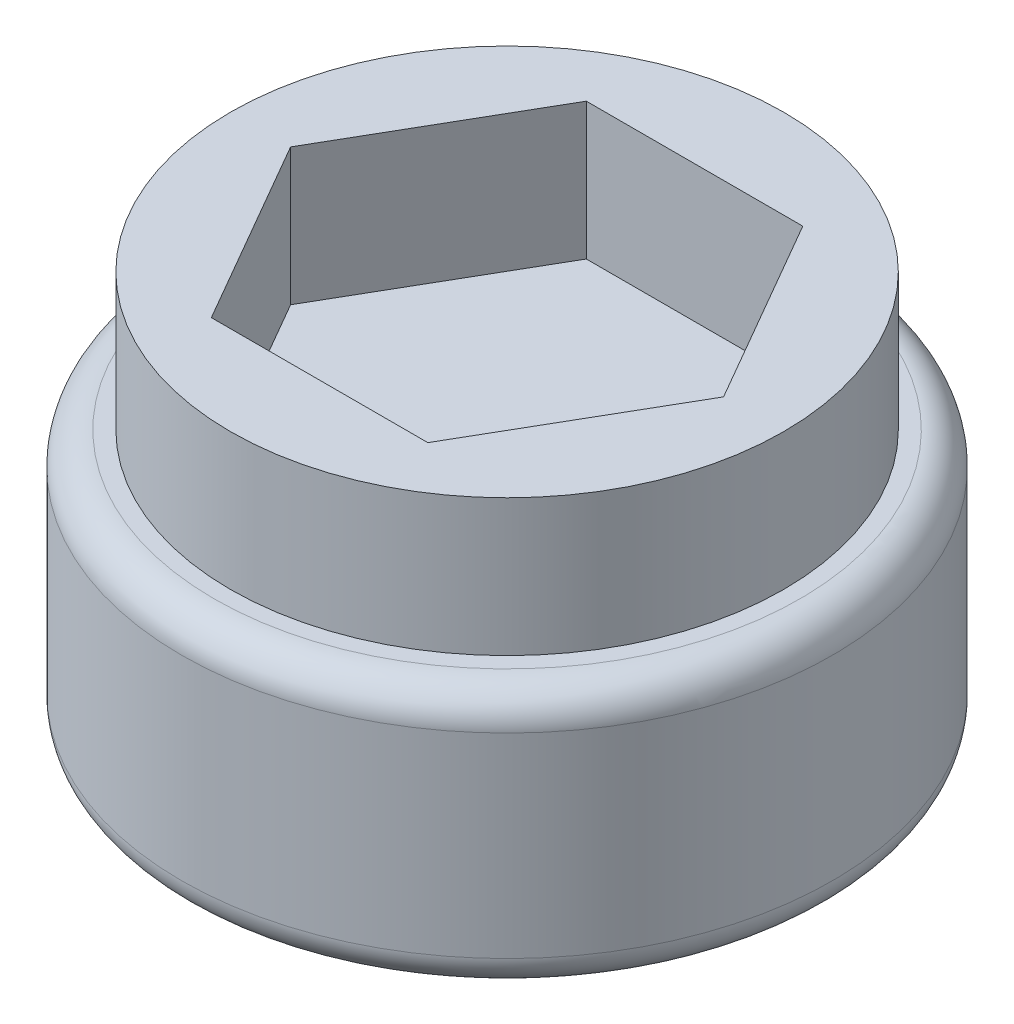
ISO-10303-21;
HEADER;
FILE_DESCRIPTION(('STEP AP214'),'2;1');
FILE_NAME('part.step','',(''),(''),'','','');
FILE_SCHEMA(('AUTOMOTIVE_DESIGN { 1 0 10303 214 1 1 1 1 }'));
ENDSEC;
DATA;
#1=APPLICATION_CONTEXT('core data for automotive mechanical design processes');
#2=APPLICATION_PROTOCOL_DEFINITION('international standard','automotive_design',2000,#1);
#3=PRODUCT_CONTEXT('',#1,'mechanical');
#4=PRODUCT('Part','Part','',(#3));
#5=PRODUCT_RELATED_PRODUCT_CATEGORY('part','',(#4));
#6=PRODUCT_DEFINITION_FORMATION('','',#4);
#7=PRODUCT_DEFINITION_CONTEXT('part definition',#1,'design');
#8=PRODUCT_DEFINITION('design','',#6,#7);
#9=PRODUCT_DEFINITION_SHAPE('','',#8);
#10=(LENGTH_UNIT() NAMED_UNIT(*) SI_UNIT(.MILLI.,.METRE.));
#11=(NAMED_UNIT(*) PLANE_ANGLE_UNIT() SI_UNIT($,.RADIAN.));
#12=(NAMED_UNIT(*) SI_UNIT($,.STERADIAN.) SOLID_ANGLE_UNIT());
#13=UNCERTAINTY_MEASURE_WITH_UNIT(LENGTH_MEASURE(1.E-05),#10,'distance_accuracy_value','');
#14=(GEOMETRIC_REPRESENTATION_CONTEXT(3) GLOBAL_UNCERTAINTY_ASSIGNED_CONTEXT((#13)) GLOBAL_UNIT_ASSIGNED_CONTEXT((#10,
#11,#12)) REPRESENTATION_CONTEXT('',''));
#15=CARTESIAN_POINT('',(0.,0.,0.));
#16=DIRECTION('',(0.,0.,1.));
#17=DIRECTION('',(1.,0.,0.));
#18=AXIS2_PLACEMENT_3D('',#15,#16,#17);
#19=CARTESIAN_POINT('',(0.,9.25,0.));
#20=DIRECTION('',(0.,1.,0.));
#21=DIRECTION('',(0.,0.,1.));
#22=AXIS2_PLACEMENT_3D('',#19,#20,#21);
#23=PLANE('',#22);
#24=CARTESIAN_POINT('',(0.,9.25,0.));
#25=DIRECTION('',(0.,1.,0.));
#26=DIRECTION('',(0.,0.,1.));
#27=AXIS2_PLACEMENT_3D('',#24,#25,#26);
#28=CIRCLE('',#27,4.5);
#29=CARTESIAN_POINT('',(0.,9.25,4.5));
#30=VERTEX_POINT('',#29);
#31=EDGE_CURVE('E11',#30,#30,#28,.T.);
#32=ORIENTED_EDGE('',*,*,#31,.T.);
#33=EDGE_LOOP('',(#32));
#34=FACE_BOUND('',#33,.T.);
#35=CARTESIAN_POINT('',(0.,9.25,0.));
#36=DIRECTION('',(0.,1.,0.));
#37=DIRECTION('',(0.,0.,1.));
#38=AXIS2_PLACEMENT_3D('',#35,#36,#37);
#39=CIRCLE('',#38,4.25);
#40=CARTESIAN_POINT('',(0.,9.25,4.25));
#41=VERTEX_POINT('',#40);
#42=EDGE_CURVE('E109',#41,#41,#39,.T.);
#43=ORIENTED_EDGE('',*,*,#42,.F.);
#44=EDGE_LOOP('',(#43));
#45=FACE_BOUND('',#44,.T.);
#46=ADVANCED_FACE('F35',(#34,#45),#23,.T.);
#47=CARTESIAN_POINT('',(0.,5.25,0.));
#48=DIRECTION('',(0.,1.,0.));
#49=DIRECTION('',(0.,0.,1.));
#50=AXIS2_PLACEMENT_3D('',#47,#48,#49);
#51=PLANE('',#50);
#52=CARTESIAN_POINT('',(0.,5.25,0.));
#53=DIRECTION('',(0.,1.,0.));
#54=DIRECTION('',(0.,0.,1.));
#55=AXIS2_PLACEMENT_3D('',#52,#53,#54);
#56=CIRCLE('',#55,4.5);
#57=CARTESIAN_POINT('',(0.,5.25,4.5));
#58=VERTEX_POINT('',#57);
#59=EDGE_CURVE('E43',#58,#58,#56,.F.);
#60=ORIENTED_EDGE('',*,*,#59,.T.);
#61=EDGE_LOOP('',(#60));
#62=FACE_BOUND('',#61,.T.);
#63=ADVANCED_FACE('F156',(#62),#51,.F.);
#64=CARTESIAN_POINT('',(0.,5.25,0.));
#65=DIRECTION('',(0.,1.,0.));
#66=DIRECTION('',(0.,0.,1.));
#67=AXIS2_PLACEMENT_3D('',#64,#65,#66);
#68=CYLINDRICAL_SURFACE('',#67,5.);
#69=CARTESIAN_POINT('',(0.,5.75,0.));
#70=DIRECTION('',(0.,1.,0.));
#71=DIRECTION('',(0.,0.,1.));
#72=AXIS2_PLACEMENT_3D('',#69,#70,#71);
#73=CIRCLE('',#72,5.);
#74=CARTESIAN_POINT('',(0.,5.75,5.));
#75=VERTEX_POINT('',#74);
#76=EDGE_CURVE('E151',#75,#75,#73,.T.);
#77=ORIENTED_EDGE('',*,*,#76,.T.);
#78=EDGE_LOOP('',(#77));
#79=FACE_BOUND('',#78,.T.);
#80=CARTESIAN_POINT('',(0.,8.75,0.));
#81=DIRECTION('',(0.,1.,0.));
#82=DIRECTION('',(0.,0.,1.));
#83=AXIS2_PLACEMENT_3D('',#80,#81,#82);
#84=CIRCLE('',#83,5.);
#85=CARTESIAN_POINT('',(0.,8.75,5.));
#86=VERTEX_POINT('',#85);
#87=EDGE_CURVE('E96',#86,#86,#84,.F.);
#88=ORIENTED_EDGE('',*,*,#87,.T.);
#89=EDGE_LOOP('',(#88));
#90=FACE_BOUND('',#89,.T.);
#91=ADVANCED_FACE('F161',(#79,#90),#68,.T.);
#92=CARTESIAN_POINT('',(0.,5.75,0.));
#93=DIRECTION('',(0.,1.,0.));
#94=DIRECTION('',(0.,0.,1.));
#95=AXIS2_PLACEMENT_3D('',#92,#93,#94);
#96=TOROIDAL_SURFACE('',#95,4.5,0.5);
#97=ORIENTED_EDGE('',*,*,#59,.F.);
#98=EDGE_LOOP('',(#97));
#99=FACE_BOUND('',#98,.T.);
#100=ORIENTED_EDGE('',*,*,#76,.F.);
#101=EDGE_LOOP('',(#100));
#102=FACE_BOUND('',#101,.T.);
#103=ADVANCED_FACE('F158',(#99,#102),#96,.T.);
#104=CARTESIAN_POINT('',(0.,8.75,0.));
#105=DIRECTION('',(0.,1.,0.));
#106=DIRECTION('',(0.,0.,1.));
#107=AXIS2_PLACEMENT_3D('',#104,#105,#106);
#108=TOROIDAL_SURFACE('',#107,4.5,0.5);
#109=ORIENTED_EDGE('',*,*,#87,.F.);
#110=EDGE_LOOP('',(#109));
#111=FACE_BOUND('',#110,.T.);
#112=ORIENTED_EDGE('',*,*,#31,.F.);
#113=EDGE_LOOP('',(#112));
#114=FACE_BOUND('',#113,.T.);
#115=ADVANCED_FACE('F37',(#111,#114),#108,.T.);
#116=CARTESIAN_POINT('',(2.49415316289918,11.35,1.44));
#117=DIRECTION('',(-0.866025403784439,0.,-0.5));
#118=DIRECTION('',(-0.5,0.,0.866025403784439));
#119=AXIS2_PLACEMENT_3D('',#116,#117,#118);
#120=PLANE('',#119);
#121=DIRECTION('',(0.5,0.,-0.866025403784439));
#122=VECTOR('',#121,1.);
#123=CARTESIAN_POINT('',(2.49415316289918,9.25,1.44));
#124=LINE('',#123,#122);
#125=CARTESIAN_POINT('',(1.66276877526612,9.25,2.88));
#126=VERTEX_POINT('',#125);
#127=CARTESIAN_POINT('',(3.32553755053224,9.25,0.));
#128=VERTEX_POINT('',#127);
#129=EDGE_CURVE('E93',#126,#128,#124,.T.);
#130=ORIENTED_EDGE('',*,*,#129,.F.);
#131=DIRECTION('',(0.,-1.,0.));
#132=VECTOR('',#131,1.);
#133=CARTESIAN_POINT('',(1.66276877526612,11.35,2.88));
#134=LINE('',#133,#132);
#135=CARTESIAN_POINT('',(1.66276877526612,11.35,2.88));
#136=VERTEX_POINT('',#135);
#137=EDGE_CURVE('E87',#136,#126,#134,.T.);
#138=ORIENTED_EDGE('',*,*,#137,.F.);
#139=DIRECTION('',(0.5,0.,-0.866025403784439));
#140=VECTOR('',#139,1.);
#141=CARTESIAN_POINT('',(2.49415316289918,11.35,1.44));
#142=LINE('',#141,#140);
#143=CARTESIAN_POINT('',(3.32553755053224,11.35,0.));
#144=VERTEX_POINT('',#143);
#145=EDGE_CURVE('E91',#136,#144,#142,.T.);
#146=ORIENTED_EDGE('',*,*,#145,.T.);
#147=DIRECTION('',(0.,-1.,0.));
#148=VECTOR('',#147,1.);
#149=CARTESIAN_POINT('',(3.32553755053224,11.35,0.));
#150=LINE('',#149,#148);
#151=EDGE_CURVE('E126',#144,#128,#150,.T.);
#152=ORIENTED_EDGE('',*,*,#151,.T.);
#153=EDGE_LOOP('',(#130,#138,#146,#152));
#154=FACE_BOUND('',#153,.T.);
#155=ADVANCED_FACE('F89',(#154),#120,.T.);
#156=CARTESIAN_POINT('',(0.,11.35,2.88));
#157=DIRECTION('',(0.,0.,-1.));
#158=DIRECTION('',(-1.,0.,0.));
#159=AXIS2_PLACEMENT_3D('',#156,#157,#158);
#160=PLANE('',#159);
#161=DIRECTION('',(1.,0.,0.));
#162=VECTOR('',#161,1.);
#163=CARTESIAN_POINT('',(0.,9.25,2.88));
#164=LINE('',#163,#162);
#165=CARTESIAN_POINT('',(-1.66276877526611,9.25,2.88));
#166=VERTEX_POINT('',#165);
#167=EDGE_CURVE('E50',#166,#126,#164,.T.);
#168=ORIENTED_EDGE('',*,*,#167,.F.);
#169=DIRECTION('',(0.,-1.,0.));
#170=VECTOR('',#169,1.);
#171=CARTESIAN_POINT('',(-1.66276877526611,11.35,2.88));
#172=LINE('',#171,#170);
#173=CARTESIAN_POINT('',(-1.66276877526611,11.35,2.88));
#174=VERTEX_POINT('',#173);
#175=EDGE_CURVE('E97',#174,#166,#172,.T.);
#176=ORIENTED_EDGE('',*,*,#175,.F.);
#177=DIRECTION('',(1.,0.,0.));
#178=VECTOR('',#177,1.);
#179=CARTESIAN_POINT('',(0.,11.35,2.88));
#180=LINE('',#179,#178);
#181=EDGE_CURVE('E104',#174,#136,#180,.T.);
#182=ORIENTED_EDGE('',*,*,#181,.T.);
#183=ORIENTED_EDGE('',*,*,#137,.T.);
#184=EDGE_LOOP('',(#168,#176,#182,#183));
#185=FACE_BOUND('',#184,.T.);
#186=ADVANCED_FACE('F111',(#185),#160,.T.);
#187=CARTESIAN_POINT('',(-2.49415316289918,11.35,1.44));
#188=DIRECTION('',(0.866025403784439,0.,-0.5));
#189=DIRECTION('',(-0.5,0.,-0.866025403784439));
#190=AXIS2_PLACEMENT_3D('',#187,#188,#189);
#191=PLANE('',#190);
#192=DIRECTION('',(0.5,0.,0.866025403784439));
#193=VECTOR('',#192,1.);
#194=CARTESIAN_POINT('',(-2.49415316289918,9.25,1.44));
#195=LINE('',#194,#193);
#196=CARTESIAN_POINT('',(-3.32553755053224,9.25,0.));
#197=VERTEX_POINT('',#196);
#198=EDGE_CURVE('E55',#197,#166,#195,.T.);
#199=ORIENTED_EDGE('',*,*,#198,.F.);
#200=DIRECTION('',(0.,-1.,0.));
#201=VECTOR('',#200,1.);
#202=CARTESIAN_POINT('',(-3.32553755053224,11.35,0.));
#203=LINE('',#202,#201);
#204=CARTESIAN_POINT('',(-3.32553755053224,11.35,0.));
#205=VERTEX_POINT('',#204);
#206=EDGE_CURVE('E145',#205,#197,#203,.T.);
#207=ORIENTED_EDGE('',*,*,#206,.F.);
#208=DIRECTION('',(0.5,0.,0.866025403784439));
#209=VECTOR('',#208,1.);
#210=CARTESIAN_POINT('',(-2.49415316289918,11.35,1.44));
#211=LINE('',#210,#209);
#212=EDGE_CURVE('E112',#205,#174,#211,.T.);
#213=ORIENTED_EDGE('',*,*,#212,.T.);
#214=ORIENTED_EDGE('',*,*,#175,.T.);
#215=EDGE_LOOP('',(#199,#207,#213,#214));
#216=FACE_BOUND('',#215,.T.);
#217=ADVANCED_FACE('F200',(#216),#191,.T.);
#218=CARTESIAN_POINT('',(-2.49415316289918,11.35,-1.44));
#219=DIRECTION('',(0.866025403784438,0.,0.5));
#220=DIRECTION('',(0.5,0.,-0.866025403784438));
#221=AXIS2_PLACEMENT_3D('',#218,#219,#220);
#222=PLANE('',#221);
#223=DIRECTION('',(-0.5,0.,0.866025403784438));
#224=VECTOR('',#223,1.);
#225=CARTESIAN_POINT('',(-2.49415316289918,9.25,-1.44));
#226=LINE('',#225,#224);
#227=CARTESIAN_POINT('',(-1.66276877526612,9.25,-2.88));
#228=VERTEX_POINT('',#227);
#229=EDGE_CURVE('E130',#228,#197,#226,.T.);
#230=ORIENTED_EDGE('',*,*,#229,.F.);
#231=DIRECTION('',(0.,-1.,0.));
#232=VECTOR('',#231,1.);
#233=CARTESIAN_POINT('',(-1.66276877526612,11.35,-2.88));
#234=LINE('',#233,#232);
#235=CARTESIAN_POINT('',(-1.66276877526612,11.35,-2.88));
#236=VERTEX_POINT('',#235);
#237=EDGE_CURVE('E142',#236,#228,#234,.T.);
#238=ORIENTED_EDGE('',*,*,#237,.F.);
#239=DIRECTION('',(-0.5,0.,0.866025403784438));
#240=VECTOR('',#239,1.);
#241=CARTESIAN_POINT('',(-2.49415316289918,11.35,-1.44));
#242=LINE('',#241,#240);
#243=EDGE_CURVE('E114',#236,#205,#242,.T.);
#244=ORIENTED_EDGE('',*,*,#243,.T.);
#245=ORIENTED_EDGE('',*,*,#206,.T.);
#246=EDGE_LOOP('',(#230,#238,#244,#245));
#247=FACE_BOUND('',#246,.T.);
#248=ADVANCED_FACE('F196',(#247),#222,.T.);
#249=CARTESIAN_POINT('',(0.,11.35,-2.88));
#250=DIRECTION('',(0.,0.,1.));
#251=DIRECTION('',(1.,0.,0.));
#252=AXIS2_PLACEMENT_3D('',#249,#250,#251);
#253=PLANE('',#252);
#254=DIRECTION('',(-1.,0.,0.));
#255=VECTOR('',#254,1.);
#256=CARTESIAN_POINT('',(0.,9.25,-2.88));
#257=LINE('',#256,#255);
#258=CARTESIAN_POINT('',(1.66276877526612,9.25,-2.88));
#259=VERTEX_POINT('',#258);
#260=EDGE_CURVE('E132',#259,#228,#257,.T.);
#261=ORIENTED_EDGE('',*,*,#260,.F.);
#262=DIRECTION('',(0.,-1.,0.));
#263=VECTOR('',#262,1.);
#264=CARTESIAN_POINT('',(1.66276877526612,11.35,-2.88));
#265=LINE('',#264,#263);
#266=CARTESIAN_POINT('',(1.66276877526612,11.35,-2.88));
#267=VERTEX_POINT('',#266);
#268=EDGE_CURVE('E139',#267,#259,#265,.T.);
#269=ORIENTED_EDGE('',*,*,#268,.F.);
#270=DIRECTION('',(-1.,0.,0.));
#271=VECTOR('',#270,1.);
#272=CARTESIAN_POINT('',(0.,11.35,-2.88));
#273=LINE('',#272,#271);
#274=EDGE_CURVE('E119',#267,#236,#273,.T.);
#275=ORIENTED_EDGE('',*,*,#274,.T.);
#276=ORIENTED_EDGE('',*,*,#237,.T.);
#277=EDGE_LOOP('',(#261,#269,#275,#276));
#278=FACE_BOUND('',#277,.T.);
#279=ADVANCED_FACE('F189',(#278),#253,.T.);
#280=CARTESIAN_POINT('',(2.49415316289918,11.35,-1.44));
#281=DIRECTION('',(-0.866025403784439,0.,0.5));
#282=DIRECTION('',(0.5,0.,0.866025403784439));
#283=AXIS2_PLACEMENT_3D('',#280,#281,#282);
#284=PLANE('',#283);
#285=DIRECTION('',(-0.5,0.,-0.866025403784439));
#286=VECTOR('',#285,1.);
#287=CARTESIAN_POINT('',(2.49415316289918,9.25,-1.44));
#288=LINE('',#287,#286);
#289=EDGE_CURVE('E134',#128,#259,#288,.T.);
#290=ORIENTED_EDGE('',*,*,#289,.F.);
#291=ORIENTED_EDGE('',*,*,#151,.F.);
#292=DIRECTION('',(-0.5,0.,-0.866025403784439));
#293=VECTOR('',#292,1.);
#294=CARTESIAN_POINT('',(2.49415316289918,11.35,-1.44));
#295=LINE('',#294,#293);
#296=EDGE_CURVE('E108',#144,#267,#295,.T.);
#297=ORIENTED_EDGE('',*,*,#296,.T.);
#298=ORIENTED_EDGE('',*,*,#268,.T.);
#299=EDGE_LOOP('',(#290,#291,#297,#298));
#300=FACE_BOUND('',#299,.T.);
#301=ADVANCED_FACE('F181',(#300),#284,.T.);
#302=CARTESIAN_POINT('',(0.,11.35,0.));
#303=DIRECTION('',(0.,-1.,0.));
#304=DIRECTION('',(0.,0.,-1.));
#305=AXIS2_PLACEMENT_3D('',#302,#303,#304);
#306=CYLINDRICAL_SURFACE('',#305,4.25);
#307=CARTESIAN_POINT('',(0.,11.35,0.));
#308=DIRECTION('',(0.,1.,0.));
#309=DIRECTION('',(0.,0.,1.));
#310=AXIS2_PLACEMENT_3D('',#307,#308,#309);
#311=CIRCLE('',#310,4.25);
#312=CARTESIAN_POINT('',(0.,11.35,4.25));
#313=VERTEX_POINT('',#312);
#314=EDGE_CURVE('E123',#313,#313,#311,.T.);
#315=ORIENTED_EDGE('',*,*,#314,.F.);
#316=EDGE_LOOP('',(#315));
#317=FACE_BOUND('',#316,.T.);
#318=ORIENTED_EDGE('',*,*,#42,.T.);
#319=EDGE_LOOP('',(#318));
#320=FACE_BOUND('',#319,.T.);
#321=ADVANCED_FACE('F179',(#317,#320),#306,.T.);
#322=CARTESIAN_POINT('',(0.,11.35,0.));
#323=DIRECTION('',(0.,1.,0.));
#324=DIRECTION('',(0.,0.,1.));
#325=AXIS2_PLACEMENT_3D('',#322,#323,#324);
#326=PLANE('',#325);
#327=ORIENTED_EDGE('',*,*,#145,.F.);
#328=ORIENTED_EDGE('',*,*,#181,.F.);
#329=ORIENTED_EDGE('',*,*,#212,.F.);
#330=ORIENTED_EDGE('',*,*,#243,.F.);
#331=ORIENTED_EDGE('',*,*,#274,.F.);
#332=ORIENTED_EDGE('',*,*,#296,.F.);
#333=EDGE_LOOP('',(#327,#328,#329,#330,#331,#332));
#334=FACE_BOUND('',#333,.T.);
#335=ORIENTED_EDGE('',*,*,#314,.T.);
#336=EDGE_LOOP('',(#335));
#337=FACE_BOUND('',#336,.T.);
#338=ADVANCED_FACE('F101',(#334,#337),#326,.T.);
#339=ORIENTED_EDGE('',*,*,#129,.T.);
#340=ORIENTED_EDGE('',*,*,#289,.T.);
#341=ORIENTED_EDGE('',*,*,#260,.T.);
#342=ORIENTED_EDGE('',*,*,#229,.T.);
#343=ORIENTED_EDGE('',*,*,#198,.T.);
#344=ORIENTED_EDGE('',*,*,#167,.T.);
#345=EDGE_LOOP('',(#339,#340,#341,#342,#343,#344));
#346=FACE_BOUND('',#345,.T.);
#347=ADVANCED_FACE('F176',(#346),#23,.T.);
#348=CLOSED_SHELL('',(#46,#63,#91,#103,#115,#155,#186,#217,#248,#279,#301,#321,#338,#347));
#349=MANIFOLD_SOLID_BREP('B2',#348);
#350=ADVANCED_BREP_SHAPE_REPRESENTATION('',(#18,#349),#14);
#351=SHAPE_DEFINITION_REPRESENTATION(#9,#350);
ENDSEC;
END-ISO-10303-21;
